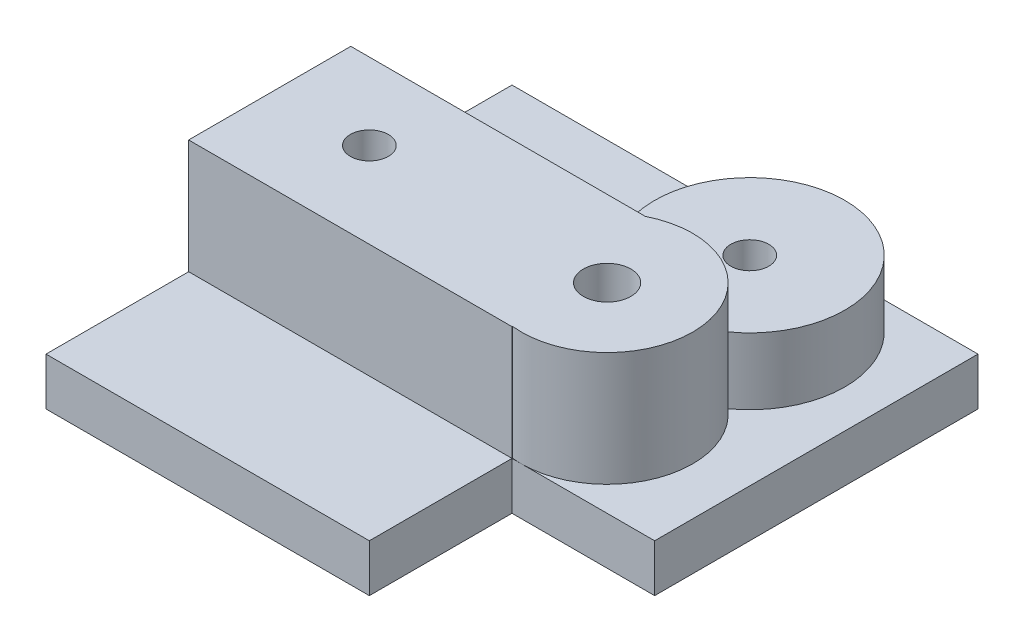
ISO-10303-21;
HEADER;
FILE_DESCRIPTION(('STEP AP214'),'2;1');
FILE_NAME('part.step','',(''),(''),'','','');
FILE_SCHEMA(('AUTOMOTIVE_DESIGN { 1 0 10303 214 1 1 1 1 }'));
ENDSEC;
DATA;
#1=APPLICATION_CONTEXT('core data for automotive mechanical design processes');
#2=APPLICATION_PROTOCOL_DEFINITION('international standard','automotive_design',2000,#1);
#3=PRODUCT_CONTEXT('',#1,'mechanical');
#4=PRODUCT('Part','Part','',(#3));
#5=PRODUCT_RELATED_PRODUCT_CATEGORY('part','',(#4));
#6=PRODUCT_DEFINITION_FORMATION('','',#4);
#7=PRODUCT_DEFINITION_CONTEXT('part definition',#1,'design');
#8=PRODUCT_DEFINITION('design','',#6,#7);
#9=PRODUCT_DEFINITION_SHAPE('','',#8);
#10=(LENGTH_UNIT() NAMED_UNIT(*) SI_UNIT(.MILLI.,.METRE.));
#11=(NAMED_UNIT(*) PLANE_ANGLE_UNIT() SI_UNIT($,.RADIAN.));
#12=(NAMED_UNIT(*) SI_UNIT($,.STERADIAN.) SOLID_ANGLE_UNIT());
#13=UNCERTAINTY_MEASURE_WITH_UNIT(LENGTH_MEASURE(1.E-05),#10,'distance_accuracy_value','');
#14=(GEOMETRIC_REPRESENTATION_CONTEXT(3) GLOBAL_UNCERTAINTY_ASSIGNED_CONTEXT((#13)) GLOBAL_UNIT_ASSIGNED_CONTEXT((#10,
#11,#12)) REPRESENTATION_CONTEXT('',''));
#15=CARTESIAN_POINT('',(0.,0.,0.));
#16=DIRECTION('',(0.,0.,1.));
#17=DIRECTION('',(1.,0.,0.));
#18=AXIS2_PLACEMENT_3D('',#15,#16,#17);
#19=CARTESIAN_POINT('',(35.,17.,-39.));
#20=DIRECTION('',(0.,-1.,0.));
#21=DIRECTION('',(0.,0.,-1.));
#22=AXIS2_PLACEMENT_3D('',#19,#20,#21);
#23=CYLINDRICAL_SURFACE('',#22,10.);
#24=DIRECTION('',(0.,-1.,0.));
#25=VECTOR('',#24,1.);
#26=CARTESIAN_POINT('',(27.8101281268334,17.,-32.049766734314));
#27=LINE('',#26,#25);
#28=CARTESIAN_POINT('',(27.8101281268334,12.,-32.049766734314));
#29=VERTEX_POINT('',#28);
#30=CARTESIAN_POINT('',(27.8101281268334,5.,-32.049766734314));
#31=VERTEX_POINT('',#30);
#32=EDGE_CURVE('E231',#29,#31,#27,.T.);
#33=ORIENTED_EDGE('',*,*,#32,.F.);
#34=CARTESIAN_POINT('',(35.,12.,-39.));
#35=DIRECTION('',(0.,1.,0.));
#36=DIRECTION('',(0.,0.,1.));
#37=AXIS2_PLACEMENT_3D('',#34,#35,#36);
#38=CIRCLE('',#37,10.);
#39=CARTESIAN_POINT('',(40.8179797944724,12.,-30.8666666666667));
#40=VERTEX_POINT('',#39);
#41=EDGE_CURVE('E254',#40,#29,#38,.T.);
#42=ORIENTED_EDGE('',*,*,#41,.F.);
#43=DIRECTION('',(0.,-1.,0.));
#44=VECTOR('',#43,1.);
#45=CARTESIAN_POINT('',(40.8179797944724,11.,-30.8666666666667));
#46=LINE('',#45,#44);
#47=CARTESIAN_POINT('',(40.8179797944724,5.,-30.8666666666667));
#48=VERTEX_POINT('',#47);
#49=EDGE_CURVE('E243',#48,#40,#46,.F.);
#50=ORIENTED_EDGE('',*,*,#49,.F.);
#51=CARTESIAN_POINT('',(35.,5.,-39.));
#52=DIRECTION('',(0.,1.,0.));
#53=DIRECTION('',(0.,0.,1.));
#54=AXIS2_PLACEMENT_3D('',#51,#52,#53);
#55=CIRCLE('',#54,10.);
#56=CARTESIAN_POINT('',(35.,5.,-49.));
#57=VERTEX_POINT('',#56);
#58=EDGE_CURVE('E258',#48,#57,#55,.T.);
#59=ORIENTED_EDGE('',*,*,#58,.T.);
#60=EDGE_CURVE('E259',#57,#31,#55,.T.);
#61=ORIENTED_EDGE('',*,*,#60,.T.);
#62=EDGE_LOOP('',(#33,#42,#50,#59,#61));
#63=FACE_BOUND('',#62,.T.);
#64=ADVANCED_FACE('F69',(#63),#23,.T.);
#65=CARTESIAN_POINT('',(0.,5.,0.));
#66=DIRECTION('',(0.,1.,0.));
#67=DIRECTION('',(0.,0.,1.));
#68=AXIS2_PLACEMENT_3D('',#65,#66,#67);
#69=PLANE('',#68);
#70=CARTESIAN_POINT('',(10.,5.,-39.));
#71=DIRECTION('',(0.,1.,0.));
#72=DIRECTION('',(0.,0.,1.));
#73=AXIS2_PLACEMENT_3D('',#70,#71,#72);
#74=CIRCLE('',#73,4.);
#75=CARTESIAN_POINT('',(10.,5.,-35.));
#76=VERTEX_POINT('',#75);
#77=EDGE_CURVE('E262',#76,#76,#74,.T.);
#78=ORIENTED_EDGE('',*,*,#77,.F.);
#79=EDGE_LOOP('',(#78));
#80=FACE_BOUND('',#79,.T.);
#81=DIRECTION('',(0.,0.,-1.));
#82=VECTOR('',#81,1.);
#83=CARTESIAN_POINT('',(0.,5.,0.));
#84=LINE('',#83,#82);
#85=CARTESIAN_POINT('',(0.,5.,-32.049766734314));
#86=VERTEX_POINT('',#85);
#87=CARTESIAN_POINT('',(0.,5.,-49.));
#88=VERTEX_POINT('',#87);
#89=EDGE_CURVE('E90',#86,#88,#84,.T.);
#90=ORIENTED_EDGE('',*,*,#89,.F.);
#91=DIRECTION('',(-1.,0.,0.));
#92=VECTOR('',#91,1.);
#93=CARTESIAN_POINT('',(34.,5.,-32.049766734314));
#94=LINE('',#93,#92);
#95=EDGE_CURVE('E85',#31,#86,#94,.T.);
#96=ORIENTED_EDGE('',*,*,#95,.F.);
#97=ORIENTED_EDGE('',*,*,#60,.F.);
#98=DIRECTION('',(1.,0.,0.));
#99=VECTOR('',#98,1.);
#100=CARTESIAN_POINT('',(0.,5.,-49.));
#101=LINE('',#100,#99);
#102=EDGE_CURVE('E290',#88,#57,#101,.T.);
#103=ORIENTED_EDGE('',*,*,#102,.F.);
#104=EDGE_LOOP('',(#90,#96,#97,#103));
#105=FACE_BOUND('',#104,.T.);
#106=ADVANCED_FACE('F371',(#80,#105),#69,.T.);
#107=CARTESIAN_POINT('',(35.,5.,-24.));
#108=DIRECTION('',(0.,1.,0.));
#109=DIRECTION('',(0.,0.,1.));
#110=AXIS2_PLACEMENT_3D('',#107,#108,#109);
#111=CIRCLE('',#110,9.);
#112=CARTESIAN_POINT('',(34.,5.,-15.0557280900008));
#113=VERTEX_POINT('',#112);
#114=CARTESIAN_POINT('',(35.,5.,-15.));
#115=VERTEX_POINT('',#114);
#116=EDGE_CURVE('E239',#113,#115,#111,.T.);
#117=ORIENTED_EDGE('',*,*,#116,.F.);
#118=DIRECTION('',(0.,0.,-1.));
#119=VECTOR('',#118,1.);
#120=CARTESIAN_POINT('',(34.,5.,-15.));
#121=LINE('',#120,#119);
#122=CARTESIAN_POINT('',(34.,5.,-15.));
#123=VERTEX_POINT('',#122);
#124=EDGE_CURVE('E199',#123,#113,#121,.T.);
#125=ORIENTED_EDGE('',*,*,#124,.F.);
#126=DIRECTION('',(-1.,0.,0.));
#127=VECTOR('',#126,1.);
#128=CARTESIAN_POINT('',(0.,5.,-15.));
#129=LINE('',#128,#127);
#130=EDGE_CURVE('E280',#115,#123,#129,.T.);
#131=ORIENTED_EDGE('',*,*,#130,.F.);
#132=EDGE_LOOP('',(#117,#125,#131));
#133=FACE_BOUND('',#132,.T.);
#134=ADVANCED_FACE('F373',(#133),#69,.T.);
#135=CARTESIAN_POINT('',(35.,5.,-24.));
#136=DIRECTION('',(0.,-1.,0.));
#137=DIRECTION('',(0.,0.,-1.));
#138=AXIS2_PLACEMENT_3D('',#135,#136,#137);
#139=CYLINDRICAL_SURFACE('',#138,2.5);
#140=CARTESIAN_POINT('',(35.,17.,-24.));
#141=DIRECTION('',(0.,1.,0.));
#142=DIRECTION('',(0.,0.,1.));
#143=AXIS2_PLACEMENT_3D('',#140,#141,#142);
#144=CIRCLE('',#143,2.5);
#145=CARTESIAN_POINT('',(35.,17.,-21.5));
#146=VERTEX_POINT('',#145);
#147=EDGE_CURVE('E235',#146,#146,#144,.T.);
#148=ORIENTED_EDGE('',*,*,#147,.T.);
#149=EDGE_LOOP('',(#148));
#150=FACE_BOUND('',#149,.T.);
#151=CARTESIAN_POINT('',(35.,0.,-24.));
#152=DIRECTION('',(0.,1.,0.));
#153=DIRECTION('',(0.,0.,1.));
#154=AXIS2_PLACEMENT_3D('',#151,#152,#153);
#155=CIRCLE('',#154,2.5);
#156=CARTESIAN_POINT('',(35.,0.,-21.5));
#157=VERTEX_POINT('',#156);
#158=EDGE_CURVE('E297',#157,#157,#155,.T.);
#159=ORIENTED_EDGE('',*,*,#158,.F.);
#160=EDGE_LOOP('',(#159));
#161=FACE_BOUND('',#160,.T.);
#162=ADVANCED_FACE('F71',(#150,#161),#139,.F.);
#163=CARTESIAN_POINT('',(35.,12.,-39.));
#164=DIRECTION('',(0.,1.,0.));
#165=DIRECTION('',(0.,0.,1.));
#166=AXIS2_PLACEMENT_3D('',#163,#164,#165);
#167=PLANE('',#166);
#168=CARTESIAN_POINT('',(35.,12.,-39.));
#169=DIRECTION('',(0.,1.,0.));
#170=DIRECTION('',(0.,0.,1.));
#171=AXIS2_PLACEMENT_3D('',#168,#169,#170);
#172=CIRCLE('',#171,2.);
#173=CARTESIAN_POINT('',(35.,12.,-37.));
#174=VERTEX_POINT('',#173);
#175=EDGE_CURVE('E250',#174,#174,#172,.T.);
#176=ORIENTED_EDGE('',*,*,#175,.F.);
#177=EDGE_LOOP('',(#176));
#178=FACE_BOUND('',#177,.T.);
#179=ORIENTED_EDGE('',*,*,#41,.T.);
#180=DIRECTION('',(1.,0.,0.));
#181=VECTOR('',#180,1.);
#182=CARTESIAN_POINT('',(35.,12.,-32.049766734314));
#183=LINE('',#182,#181);
#184=CARTESIAN_POINT('',(30.9749216749073,12.,-32.049766734314));
#185=VERTEX_POINT('',#184);
#186=EDGE_CURVE('E228',#29,#185,#183,.T.);
#187=ORIENTED_EDGE('',*,*,#186,.T.);
#188=CARTESIAN_POINT('',(35.,12.,-24.));
#189=DIRECTION('',(0.,1.,0.));
#190=DIRECTION('',(0.,0.,1.));
#191=AXIS2_PLACEMENT_3D('',#188,#189,#190);
#192=CIRCLE('',#191,9.);
#193=EDGE_CURVE('E12',#185,#40,#192,.F.);
#194=ORIENTED_EDGE('',*,*,#193,.T.);
#195=EDGE_LOOP('',(#179,#187,#194));
#196=FACE_BOUND('',#195,.T.);
#197=ADVANCED_FACE('F394',(#178,#196),#167,.T.);
#198=CARTESIAN_POINT('',(35.,17.,-24.));
#199=DIRECTION('',(0.,-1.,0.));
#200=DIRECTION('',(0.,0.,-1.));
#201=AXIS2_PLACEMENT_3D('',#198,#199,#200);
#202=CYLINDRICAL_SURFACE('',#201,9.);
#203=DIRECTION('',(0.,-1.,0.));
#204=VECTOR('',#203,1.);
#205=CARTESIAN_POINT('',(30.9749216749073,17.,-32.049766734314));
#206=LINE('',#205,#204);
#207=CARTESIAN_POINT('',(30.9749216749073,17.,-32.049766734314));
#208=VERTEX_POINT('',#207);
#209=EDGE_CURVE('E224',#208,#185,#206,.T.);
#210=ORIENTED_EDGE('',*,*,#209,.F.);
#211=CARTESIAN_POINT('',(35.,17.,-24.));
#212=DIRECTION('',(0.,1.,0.));
#213=DIRECTION('',(0.,0.,1.));
#214=AXIS2_PLACEMENT_3D('',#211,#212,#213);
#215=CIRCLE('',#214,9.);
#216=CARTESIAN_POINT('',(34.,17.,-15.0557280900008));
#217=VERTEX_POINT('',#216);
#218=EDGE_CURVE('E240',#217,#208,#215,.T.);
#219=ORIENTED_EDGE('',*,*,#218,.F.);
#220=DIRECTION('',(0.,-1.,0.));
#221=VECTOR('',#220,1.);
#222=CARTESIAN_POINT('',(34.,17.,-15.0557280900008));
#223=LINE('',#222,#221);
#224=EDGE_CURVE('E218',#113,#217,#223,.F.);
#225=ORIENTED_EDGE('',*,*,#224,.F.);
#226=ORIENTED_EDGE('',*,*,#116,.T.);
#227=EDGE_CURVE('E244',#115,#48,#111,.T.);
#228=ORIENTED_EDGE('',*,*,#227,.T.);
#229=ORIENTED_EDGE('',*,*,#49,.T.);
#230=ORIENTED_EDGE('',*,*,#193,.F.);
#231=EDGE_LOOP('',(#210,#219,#225,#226,#228,#229,#230));
#232=FACE_BOUND('',#231,.T.);
#233=ADVANCED_FACE('F386',(#232),#202,.T.);
#234=DIRECTION('',(-1.,0.,0.));
#235=VECTOR('',#234,1.);
#236=CARTESIAN_POINT('',(34.,5.,-15.));
#237=LINE('',#236,#235);
#238=CARTESIAN_POINT('',(0.,5.,-15.));
#239=VERTEX_POINT('',#238);
#240=EDGE_CURVE('E211',#123,#239,#237,.T.);
#241=ORIENTED_EDGE('',*,*,#240,.T.);
#242=CARTESIAN_POINT('',(0.,5.,0.));
#243=VERTEX_POINT('',#242);
#244=EDGE_CURVE('E174',#243,#239,#84,.T.);
#245=ORIENTED_EDGE('',*,*,#244,.F.);
#246=DIRECTION('',(1.,0.,0.));
#247=VECTOR('',#246,1.);
#248=CARTESIAN_POINT('',(0.,5.,0.));
#249=LINE('',#248,#247);
#250=CARTESIAN_POINT('',(34.,5.,0.));
#251=VERTEX_POINT('',#250);
#252=EDGE_CURVE('E271',#243,#251,#249,.T.);
#253=ORIENTED_EDGE('',*,*,#252,.T.);
#254=DIRECTION('',(0.,0.,-1.));
#255=VECTOR('',#254,1.);
#256=CARTESIAN_POINT('',(34.,5.,0.));
#257=LINE('',#256,#255);
#258=EDGE_CURVE('E275',#251,#123,#257,.T.);
#259=ORIENTED_EDGE('',*,*,#258,.T.);
#260=EDGE_LOOP('',(#241,#245,#253,#259));
#261=FACE_BOUND('',#260,.T.);
#262=ADVANCED_FACE('F375',(#261),#69,.T.);
#263=ORIENTED_EDGE('',*,*,#58,.F.);
#264=ORIENTED_EDGE('',*,*,#227,.F.);
#265=CARTESIAN_POINT('',(49.,5.,-15.));
#266=VERTEX_POINT('',#265);
#267=EDGE_CURVE('E281',#266,#115,#129,.T.);
#268=ORIENTED_EDGE('',*,*,#267,.F.);
#269=DIRECTION('',(0.,0.,-1.));
#270=VECTOR('',#269,1.);
#271=CARTESIAN_POINT('',(49.,5.,0.));
#272=LINE('',#271,#270);
#273=CARTESIAN_POINT('',(49.,5.,-49.));
#274=VERTEX_POINT('',#273);
#275=EDGE_CURVE('E285',#266,#274,#272,.T.);
#276=ORIENTED_EDGE('',*,*,#275,.T.);
#277=EDGE_CURVE('E289',#57,#274,#101,.T.);
#278=ORIENTED_EDGE('',*,*,#277,.F.);
#279=EDGE_LOOP('',(#263,#264,#268,#276,#278));
#280=FACE_BOUND('',#279,.T.);
#281=ADVANCED_FACE('F381',(#280),#69,.T.);
#282=CARTESIAN_POINT('',(35.,5.,-39.));
#283=DIRECTION('',(0.,-1.,0.));
#284=DIRECTION('',(0.,0.,-1.));
#285=AXIS2_PLACEMENT_3D('',#282,#283,#284);
#286=CYLINDRICAL_SURFACE('',#285,2.);
#287=CARTESIAN_POINT('',(35.,0.,-39.));
#288=DIRECTION('',(0.,1.,0.));
#289=DIRECTION('',(0.,0.,1.));
#290=AXIS2_PLACEMENT_3D('',#287,#288,#289);
#291=CIRCLE('',#290,2.);
#292=CARTESIAN_POINT('',(35.,0.,-37.));
#293=VERTEX_POINT('',#292);
#294=EDGE_CURVE('E305',#293,#293,#291,.T.);
#295=ORIENTED_EDGE('',*,*,#294,.F.);
#296=EDGE_LOOP('',(#295));
#297=FACE_BOUND('',#296,.T.);
#298=ORIENTED_EDGE('',*,*,#175,.T.);
#299=EDGE_LOOP('',(#298));
#300=FACE_BOUND('',#299,.T.);
#301=ADVANCED_FACE('F392',(#297,#300),#286,.F.);
#302=CARTESIAN_POINT('',(10.,5.,-39.));
#303=DIRECTION('',(0.,-1.,0.));
#304=DIRECTION('',(0.,0.,-1.));
#305=AXIS2_PLACEMENT_3D('',#302,#303,#304);
#306=CYLINDRICAL_SURFACE('',#305,2.);
#307=CARTESIAN_POINT('',(10.,0.,-39.));
#308=DIRECTION('',(0.,1.,0.));
#309=DIRECTION('',(0.,0.,1.));
#310=AXIS2_PLACEMENT_3D('',#307,#308,#309);
#311=CIRCLE('',#310,2.);
#312=CARTESIAN_POINT('',(10.,0.,-37.));
#313=VERTEX_POINT('',#312);
#314=EDGE_CURVE('E309',#313,#313,#311,.T.);
#315=ORIENTED_EDGE('',*,*,#314,.F.);
#316=EDGE_LOOP('',(#315));
#317=FACE_BOUND('',#316,.T.);
#318=CARTESIAN_POINT('',(10.,3.,-39.));
#319=DIRECTION('',(0.,1.,0.));
#320=DIRECTION('',(0.,0.,1.));
#321=AXIS2_PLACEMENT_3D('',#318,#319,#320);
#322=CIRCLE('',#321,2.);
#323=CARTESIAN_POINT('',(10.,3.,-37.));
#324=VERTEX_POINT('',#323);
#325=EDGE_CURVE('E267',#324,#324,#322,.T.);
#326=ORIENTED_EDGE('',*,*,#325,.T.);
#327=EDGE_LOOP('',(#326));
#328=FACE_BOUND('',#327,.T.);
#329=ADVANCED_FACE('F356',(#317,#328),#306,.F.);
#330=CARTESIAN_POINT('',(0.,5.,0.));
#331=DIRECTION('',(0.,0.,-1.));
#332=DIRECTION('',(-1.,0.,0.));
#333=AXIS2_PLACEMENT_3D('',#330,#331,#332);
#334=PLANE('',#333);
#335=DIRECTION('',(1.,0.,0.));
#336=VECTOR('',#335,1.);
#337=CARTESIAN_POINT('',(0.,0.,0.));
#338=LINE('',#337,#336);
#339=CARTESIAN_POINT('',(0.,0.,0.));
#340=VERTEX_POINT('',#339);
#341=CARTESIAN_POINT('',(34.,0.,0.));
#342=VERTEX_POINT('',#341);
#343=EDGE_CURVE('E313',#340,#342,#338,.T.);
#344=ORIENTED_EDGE('',*,*,#343,.T.);
#345=DIRECTION('',(0.,-1.,0.));
#346=VECTOR('',#345,1.);
#347=CARTESIAN_POINT('',(34.,5.,0.));
#348=LINE('',#347,#346);
#349=EDGE_CURVE('E78',#251,#342,#348,.T.);
#350=ORIENTED_EDGE('',*,*,#349,.F.);
#351=ORIENTED_EDGE('',*,*,#252,.F.);
#352=DIRECTION('',(0.,-1.,0.));
#353=VECTOR('',#352,1.);
#354=CARTESIAN_POINT('',(0.,5.,0.));
#355=LINE('',#354,#353);
#356=EDGE_CURVE('E296',#243,#340,#355,.T.);
#357=ORIENTED_EDGE('',*,*,#356,.T.);
#358=EDGE_LOOP('',(#344,#350,#351,#357));
#359=FACE_BOUND('',#358,.T.);
#360=ADVANCED_FACE('F438',(#359),#334,.F.);
#361=CARTESIAN_POINT('',(34.,5.,0.));
#362=DIRECTION('',(-1.,0.,0.));
#363=DIRECTION('',(0.,0.,1.));
#364=AXIS2_PLACEMENT_3D('',#361,#362,#363);
#365=PLANE('',#364);
#366=DIRECTION('',(0.,0.,-1.));
#367=VECTOR('',#366,1.);
#368=CARTESIAN_POINT('',(34.,0.,0.));
#369=LINE('',#368,#367);
#370=CARTESIAN_POINT('',(34.,0.,-15.));
#371=VERTEX_POINT('',#370);
#372=EDGE_CURVE('E317',#342,#371,#369,.T.);
#373=ORIENTED_EDGE('',*,*,#372,.T.);
#374=DIRECTION('',(0.,-1.,0.));
#375=VECTOR('',#374,1.);
#376=CARTESIAN_POINT('',(34.,5.,-15.));
#377=LINE('',#376,#375);
#378=EDGE_CURVE('E347',#123,#371,#377,.T.);
#379=ORIENTED_EDGE('',*,*,#378,.F.);
#380=ORIENTED_EDGE('',*,*,#258,.F.);
#381=ORIENTED_EDGE('',*,*,#349,.T.);
#382=EDGE_LOOP('',(#373,#379,#380,#381));
#383=FACE_BOUND('',#382,.T.);
#384=ADVANCED_FACE('F401',(#383),#365,.F.);
#385=CARTESIAN_POINT('',(0.,5.,-15.));
#386=DIRECTION('',(0.,0.,1.));
#387=DIRECTION('',(1.,0.,0.));
#388=AXIS2_PLACEMENT_3D('',#385,#386,#387);
#389=PLANE('',#388);
#390=DIRECTION('',(-1.,0.,0.));
#391=VECTOR('',#390,1.);
#392=CARTESIAN_POINT('',(0.,0.,-15.));
#393=LINE('',#392,#391);
#394=CARTESIAN_POINT('',(49.,0.,-15.));
#395=VERTEX_POINT('',#394);
#396=EDGE_CURVE('E321',#395,#371,#393,.T.);
#397=ORIENTED_EDGE('',*,*,#396,.F.);
#398=DIRECTION('',(0.,-1.,0.));
#399=VECTOR('',#398,1.);
#400=CARTESIAN_POINT('',(49.,5.,-15.));
#401=LINE('',#400,#399);
#402=EDGE_CURVE('E344',#266,#395,#401,.T.);
#403=ORIENTED_EDGE('',*,*,#402,.F.);
#404=ORIENTED_EDGE('',*,*,#267,.T.);
#405=ORIENTED_EDGE('',*,*,#130,.T.);
#406=ORIENTED_EDGE('',*,*,#378,.T.);
#407=EDGE_LOOP('',(#397,#403,#404,#405,#406));
#408=FACE_BOUND('',#407,.T.);
#409=ADVANCED_FACE('F428',(#408),#389,.T.);
#410=CARTESIAN_POINT('',(49.,5.,0.));
#411=DIRECTION('',(-1.,0.,0.));
#412=DIRECTION('',(0.,0.,1.));
#413=AXIS2_PLACEMENT_3D('',#410,#411,#412);
#414=PLANE('',#413);
#415=DIRECTION('',(0.,0.,-1.));
#416=VECTOR('',#415,1.);
#417=CARTESIAN_POINT('',(49.,0.,0.));
#418=LINE('',#417,#416);
#419=CARTESIAN_POINT('',(49.,0.,-49.));
#420=VERTEX_POINT('',#419);
#421=EDGE_CURVE('E325',#395,#420,#418,.T.);
#422=ORIENTED_EDGE('',*,*,#421,.T.);
#423=DIRECTION('',(0.,-1.,0.));
#424=VECTOR('',#423,1.);
#425=CARTESIAN_POINT('',(49.,5.,-49.));
#426=LINE('',#425,#424);
#427=EDGE_CURVE('E341',#274,#420,#426,.T.);
#428=ORIENTED_EDGE('',*,*,#427,.F.);
#429=ORIENTED_EDGE('',*,*,#275,.F.);
#430=ORIENTED_EDGE('',*,*,#402,.T.);
#431=EDGE_LOOP('',(#422,#428,#429,#430));
#432=FACE_BOUND('',#431,.T.);
#433=ADVANCED_FACE('F432',(#432),#414,.F.);
#434=CARTESIAN_POINT('',(0.,5.,-49.));
#435=DIRECTION('',(0.,0.,-1.));
#436=DIRECTION('',(-1.,0.,0.));
#437=AXIS2_PLACEMENT_3D('',#434,#435,#436);
#438=PLANE('',#437);
#439=DIRECTION('',(1.,0.,0.));
#440=VECTOR('',#439,1.);
#441=CARTESIAN_POINT('',(0.,0.,-49.));
#442=LINE('',#441,#440);
#443=CARTESIAN_POINT('',(0.,0.,-49.));
#444=VERTEX_POINT('',#443);
#445=EDGE_CURVE('E329',#444,#420,#442,.T.);
#446=ORIENTED_EDGE('',*,*,#445,.F.);
#447=DIRECTION('',(0.,-1.,0.));
#448=VECTOR('',#447,1.);
#449=CARTESIAN_POINT('',(0.,5.,-49.));
#450=LINE('',#449,#448);
#451=EDGE_CURVE('E338',#88,#444,#450,.T.);
#452=ORIENTED_EDGE('',*,*,#451,.F.);
#453=ORIENTED_EDGE('',*,*,#102,.T.);
#454=ORIENTED_EDGE('',*,*,#277,.T.);
#455=ORIENTED_EDGE('',*,*,#427,.T.);
#456=EDGE_LOOP('',(#446,#452,#453,#454,#455));
#457=FACE_BOUND('',#456,.T.);
#458=ADVANCED_FACE('F414',(#457),#438,.T.);
#459=CARTESIAN_POINT('',(10.,5.,-24.));
#460=DIRECTION('',(0.,-1.,0.));
#461=DIRECTION('',(0.,0.,-1.));
#462=AXIS2_PLACEMENT_3D('',#459,#460,#461);
#463=CYLINDRICAL_SURFACE('',#462,2.);
#464=CARTESIAN_POINT('',(10.,0.,-24.));
#465=DIRECTION('',(0.,1.,0.));
#466=DIRECTION('',(0.,0.,1.));
#467=AXIS2_PLACEMENT_3D('',#464,#465,#466);
#468=CIRCLE('',#467,2.);
#469=CARTESIAN_POINT('',(10.,0.,-22.));
#470=VERTEX_POINT('',#469);
#471=EDGE_CURVE('E301',#470,#470,#468,.T.);
#472=ORIENTED_EDGE('',*,*,#471,.F.);
#473=EDGE_LOOP('',(#472));
#474=FACE_BOUND('',#473,.T.);
#475=CARTESIAN_POINT('',(10.,17.,-24.));
#476=DIRECTION('',(0.,1.,0.));
#477=DIRECTION('',(0.,0.,1.));
#478=AXIS2_PLACEMENT_3D('',#475,#476,#477);
#479=CIRCLE('',#478,2.);
#480=CARTESIAN_POINT('',(10.,17.,-22.));
#481=VERTEX_POINT('',#480);
#482=EDGE_CURVE('E205',#481,#481,#479,.T.);
#483=ORIENTED_EDGE('',*,*,#482,.T.);
#484=EDGE_LOOP('',(#483));
#485=FACE_BOUND('',#484,.T.);
#486=ADVANCED_FACE('F452',(#474,#485),#463,.F.);
#487=CARTESIAN_POINT('',(0.,5.,0.));
#488=DIRECTION('',(-1.,0.,0.));
#489=DIRECTION('',(0.,0.,1.));
#490=AXIS2_PLACEMENT_3D('',#487,#488,#489);
#491=PLANE('',#490);
#492=DIRECTION('',(0.,0.,-1.));
#493=VECTOR('',#492,1.);
#494=CARTESIAN_POINT('',(0.,0.,0.));
#495=LINE('',#494,#493);
#496=EDGE_CURVE('E276',#340,#444,#495,.T.);
#497=ORIENTED_EDGE('',*,*,#496,.F.);
#498=ORIENTED_EDGE('',*,*,#356,.F.);
#499=ORIENTED_EDGE('',*,*,#244,.T.);
#500=DIRECTION('',(0.,-1.,0.));
#501=VECTOR('',#500,1.);
#502=CARTESIAN_POINT('',(0.,17.,-15.));
#503=LINE('',#502,#501);
#504=CARTESIAN_POINT('',(0.,17.,-15.));
#505=VERTEX_POINT('',#504);
#506=EDGE_CURVE('E167',#505,#239,#503,.T.);
#507=ORIENTED_EDGE('',*,*,#506,.F.);
#508=DIRECTION('',(0.,0.,-1.));
#509=VECTOR('',#508,1.);
#510=CARTESIAN_POINT('',(0.,17.,-15.));
#511=LINE('',#510,#509);
#512=CARTESIAN_POINT('',(0.,17.,-32.049766734314));
#513=VERTEX_POINT('',#512);
#514=EDGE_CURVE('E172',#505,#513,#511,.T.);
#515=ORIENTED_EDGE('',*,*,#514,.T.);
#516=DIRECTION('',(0.,-1.,0.));
#517=VECTOR('',#516,1.);
#518=CARTESIAN_POINT('',(0.,17.,-32.049766734314));
#519=LINE('',#518,#517);
#520=EDGE_CURVE('E179',#513,#86,#519,.T.);
#521=ORIENTED_EDGE('',*,*,#520,.T.);
#522=ORIENTED_EDGE('',*,*,#89,.T.);
#523=ORIENTED_EDGE('',*,*,#451,.T.);
#524=EDGE_LOOP('',(#497,#498,#499,#507,#515,#521,#522,#523));
#525=FACE_BOUND('',#524,.T.);
#526=ADVANCED_FACE('F170',(#525),#491,.T.);
#527=CARTESIAN_POINT('',(0.,0.,0.));
#528=DIRECTION('',(0.,1.,0.));
#529=DIRECTION('',(0.,0.,1.));
#530=AXIS2_PLACEMENT_3D('',#527,#528,#529);
#531=PLANE('',#530);
#532=ORIENTED_EDGE('',*,*,#158,.T.);
#533=EDGE_LOOP('',(#532));
#534=FACE_BOUND('',#533,.T.);
#535=ORIENTED_EDGE('',*,*,#471,.T.);
#536=EDGE_LOOP('',(#535));
#537=FACE_BOUND('',#536,.T.);
#538=ORIENTED_EDGE('',*,*,#294,.T.);
#539=EDGE_LOOP('',(#538));
#540=FACE_BOUND('',#539,.T.);
#541=ORIENTED_EDGE('',*,*,#314,.T.);
#542=EDGE_LOOP('',(#541));
#543=FACE_BOUND('',#542,.T.);
#544=ORIENTED_EDGE('',*,*,#343,.F.);
#545=ORIENTED_EDGE('',*,*,#496,.T.);
#546=ORIENTED_EDGE('',*,*,#445,.T.);
#547=ORIENTED_EDGE('',*,*,#421,.F.);
#548=ORIENTED_EDGE('',*,*,#396,.T.);
#549=ORIENTED_EDGE('',*,*,#372,.F.);
#550=EDGE_LOOP('',(#544,#545,#546,#547,#548,#549));
#551=FACE_BOUND('',#550,.T.);
#552=ADVANCED_FACE('F367',(#534,#537,#540,#543,#551),#531,.F.);
#553=CARTESIAN_POINT('',(10.,3.,-39.));
#554=DIRECTION('',(0.,1.,0.));
#555=DIRECTION('',(0.,0.,1.));
#556=AXIS2_PLACEMENT_3D('',#553,#554,#555);
#557=CYLINDRICAL_SURFACE('',#556,4.);
#558=CARTESIAN_POINT('',(10.,3.,-39.));
#559=DIRECTION('',(0.,1.,0.));
#560=DIRECTION('',(0.,0.,1.));
#561=AXIS2_PLACEMENT_3D('',#558,#559,#560);
#562=CIRCLE('',#561,4.);
#563=CARTESIAN_POINT('',(10.,3.,-35.));
#564=VERTEX_POINT('',#563);
#565=EDGE_CURVE('E263',#564,#564,#562,.T.);
#566=ORIENTED_EDGE('',*,*,#565,.F.);
#567=EDGE_LOOP('',(#566));
#568=FACE_BOUND('',#567,.T.);
#569=ORIENTED_EDGE('',*,*,#77,.T.);
#570=EDGE_LOOP('',(#569));
#571=FACE_BOUND('',#570,.T.);
#572=ADVANCED_FACE('F361',(#568,#571),#557,.F.);
#573=CARTESIAN_POINT('',(10.,3.,-39.));
#574=DIRECTION('',(0.,1.,0.));
#575=DIRECTION('',(0.,0.,1.));
#576=AXIS2_PLACEMENT_3D('',#573,#574,#575);
#577=PLANE('',#576);
#578=ORIENTED_EDGE('',*,*,#325,.F.);
#579=EDGE_LOOP('',(#578));
#580=FACE_BOUND('',#579,.T.);
#581=ORIENTED_EDGE('',*,*,#565,.T.);
#582=EDGE_LOOP('',(#581));
#583=FACE_BOUND('',#582,.T.);
#584=ADVANCED_FACE('F358',(#580,#583),#577,.T.);
#585=CARTESIAN_POINT('',(35.,17.,-24.));
#586=DIRECTION('',(0.,1.,0.));
#587=DIRECTION('',(0.,0.,1.));
#588=AXIS2_PLACEMENT_3D('',#585,#586,#587);
#589=PLANE('',#588);
#590=ORIENTED_EDGE('',*,*,#147,.F.);
#591=EDGE_LOOP('',(#590));
#592=FACE_BOUND('',#591,.T.);
#593=ORIENTED_EDGE('',*,*,#218,.T.);
#594=DIRECTION('',(-1.,0.,0.));
#595=VECTOR('',#594,1.);
#596=CARTESIAN_POINT('',(34.,17.,-32.049766734314));
#597=LINE('',#596,#595);
#598=EDGE_CURVE('E190',#208,#513,#597,.T.);
#599=ORIENTED_EDGE('',*,*,#598,.T.);
#600=ORIENTED_EDGE('',*,*,#514,.F.);
#601=DIRECTION('',(-1.,0.,0.));
#602=VECTOR('',#601,1.);
#603=CARTESIAN_POINT('',(34.,17.,-15.));
#604=LINE('',#603,#602);
#605=CARTESIAN_POINT('',(34.,17.,-15.));
#606=VERTEX_POINT('',#605);
#607=EDGE_CURVE('E188',#606,#505,#604,.T.);
#608=ORIENTED_EDGE('',*,*,#607,.F.);
#609=DIRECTION('',(0.,0.,-1.));
#610=VECTOR('',#609,1.);
#611=CARTESIAN_POINT('',(34.,17.,-15.));
#612=LINE('',#611,#610);
#613=EDGE_CURVE('E180',#606,#217,#612,.T.);
#614=ORIENTED_EDGE('',*,*,#613,.T.);
#615=EDGE_LOOP('',(#593,#599,#600,#608,#614));
#616=FACE_BOUND('',#615,.T.);
#617=ORIENTED_EDGE('',*,*,#482,.F.);
#618=EDGE_LOOP('',(#617));
#619=FACE_BOUND('',#618,.T.);
#620=ADVANCED_FACE('F185',(#592,#616,#619),#589,.T.);
#621=CARTESIAN_POINT('',(34.,17.,-15.));
#622=DIRECTION('',(-1.,0.,0.));
#623=DIRECTION('',(0.,0.,1.));
#624=AXIS2_PLACEMENT_3D('',#621,#622,#623);
#625=PLANE('',#624);
#626=ORIENTED_EDGE('',*,*,#124,.T.);
#627=ORIENTED_EDGE('',*,*,#224,.T.);
#628=ORIENTED_EDGE('',*,*,#613,.F.);
#629=DIRECTION('',(0.,-1.,0.));
#630=VECTOR('',#629,1.);
#631=CARTESIAN_POINT('',(34.,17.,-15.));
#632=LINE('',#631,#630);
#633=EDGE_CURVE('E196',#606,#123,#632,.T.);
#634=ORIENTED_EDGE('',*,*,#633,.T.);
#635=EDGE_LOOP('',(#626,#627,#628,#634));
#636=FACE_BOUND('',#635,.T.);
#637=ADVANCED_FACE('F406',(#636),#625,.F.);
#638=CARTESIAN_POINT('',(34.,17.,-32.049766734314));
#639=DIRECTION('',(0.,0.,1.));
#640=DIRECTION('',(1.,0.,0.));
#641=AXIS2_PLACEMENT_3D('',#638,#639,#640);
#642=PLANE('',#641);
#643=ORIENTED_EDGE('',*,*,#186,.F.);
#644=ORIENTED_EDGE('',*,*,#32,.T.);
#645=ORIENTED_EDGE('',*,*,#95,.T.);
#646=ORIENTED_EDGE('',*,*,#520,.F.);
#647=ORIENTED_EDGE('',*,*,#598,.F.);
#648=ORIENTED_EDGE('',*,*,#209,.T.);
#649=EDGE_LOOP('',(#643,#644,#645,#646,#647,#648));
#650=FACE_BOUND('',#649,.T.);
#651=ADVANCED_FACE('F409',(#650),#642,.F.);
#652=CARTESIAN_POINT('',(34.,17.,-15.));
#653=DIRECTION('',(0.,0.,1.));
#654=DIRECTION('',(1.,0.,0.));
#655=AXIS2_PLACEMENT_3D('',#652,#653,#654);
#656=PLANE('',#655);
#657=ORIENTED_EDGE('',*,*,#240,.F.);
#658=ORIENTED_EDGE('',*,*,#633,.F.);
#659=ORIENTED_EDGE('',*,*,#607,.T.);
#660=ORIENTED_EDGE('',*,*,#506,.T.);
#661=EDGE_LOOP('',(#657,#658,#659,#660));
#662=FACE_BOUND('',#661,.T.);
#663=ADVANCED_FACE('F194',(#662),#656,.T.);
#664=CLOSED_SHELL('',(#64,#106,#134,#162,#197,#233,#262,#281,#301,#329,#360,#384,#409,#433,#458,
#486,#526,#552,#572,#584,#620,#637,#651,#663));
#665=MANIFOLD_SOLID_BREP('B2',#664);
#666=ADVANCED_BREP_SHAPE_REPRESENTATION('',(#18,#665),#14);
#667=SHAPE_DEFINITION_REPRESENTATION(#9,#666);
ENDSEC;
END-ISO-10303-21;
